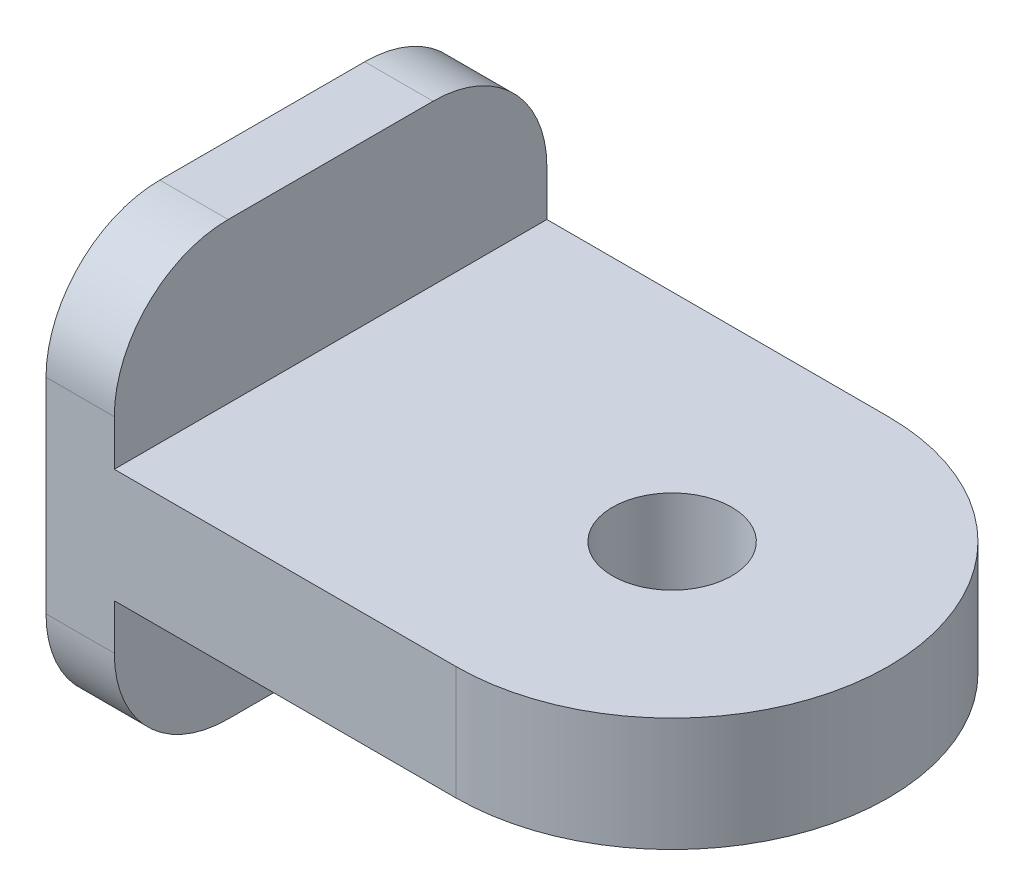
ISO-10303-21;
HEADER;
FILE_DESCRIPTION(('STEP AP214'),'2;1');
FILE_NAME('part.step','',(''),(''),'','','');
FILE_SCHEMA(('AUTOMOTIVE_DESIGN { 1 0 10303 214 1 1 1 1 }'));
ENDSEC;
DATA;
#1=APPLICATION_CONTEXT('core data for automotive mechanical design processes');
#2=APPLICATION_PROTOCOL_DEFINITION('international standard','automotive_design',2000,#1);
#3=PRODUCT_CONTEXT('',#1,'mechanical');
#4=PRODUCT('Part','Part','',(#3));
#5=PRODUCT_RELATED_PRODUCT_CATEGORY('part','',(#4));
#6=PRODUCT_DEFINITION_FORMATION('','',#4);
#7=PRODUCT_DEFINITION_CONTEXT('part definition',#1,'design');
#8=PRODUCT_DEFINITION('design','',#6,#7);
#9=PRODUCT_DEFINITION_SHAPE('','',#8);
#10=(LENGTH_UNIT() NAMED_UNIT(*) SI_UNIT(.MILLI.,.METRE.));
#11=(NAMED_UNIT(*) PLANE_ANGLE_UNIT() SI_UNIT($,.RADIAN.));
#12=(NAMED_UNIT(*) SI_UNIT($,.STERADIAN.) SOLID_ANGLE_UNIT());
#13=UNCERTAINTY_MEASURE_WITH_UNIT(LENGTH_MEASURE(1.E-05),#10,'distance_accuracy_value','');
#14=(GEOMETRIC_REPRESENTATION_CONTEXT(3) GLOBAL_UNCERTAINTY_ASSIGNED_CONTEXT((#13)) GLOBAL_UNIT_ASSIGNED_CONTEXT((#10,
#11,#12)) REPRESENTATION_CONTEXT('',''));
#15=CARTESIAN_POINT('',(0.,0.,0.));
#16=DIRECTION('',(0.,0.,1.));
#17=DIRECTION('',(1.,0.,0.));
#18=AXIS2_PLACEMENT_3D('',#15,#16,#17);
#19=CARTESIAN_POINT('',(20.,4.5,4.5));
#20=DIRECTION('',(1.,0.,0.));
#21=DIRECTION('',(0.,0.,-1.));
#22=AXIS2_PLACEMENT_3D('',#19,#20,#21);
#23=PLANE('',#22);
#24=DIRECTION('',(0.,0.,1.));
#25=VECTOR('',#24,1.);
#26=CARTESIAN_POINT('',(20.,2.5,9.5));
#27=LINE('',#26,#25);
#28=CARTESIAN_POINT('',(20.,2.5,-9.5));
#29=VERTEX_POINT('',#28);
#30=CARTESIAN_POINT('',(20.,2.5,9.5));
#31=VERTEX_POINT('',#30);
#32=EDGE_CURVE('E48',#29,#31,#27,.T.);
#33=ORIENTED_EDGE('',*,*,#32,.F.);
#34=DIRECTION('',(0.,1.,0.));
#35=VECTOR('',#34,1.);
#36=CARTESIAN_POINT('',(20.,-4.5,-9.5));
#37=LINE('',#36,#35);
#38=CARTESIAN_POINT('',(20.,4.5,-9.5));
#39=VERTEX_POINT('',#38);
#40=EDGE_CURVE('E172',#29,#39,#37,.T.);
#41=ORIENTED_EDGE('',*,*,#40,.T.);
#42=CARTESIAN_POINT('',(20.,4.5,-4.5));
#43=DIRECTION('',(1.,0.,0.));
#44=DIRECTION('',(0.,0.,-1.));
#45=AXIS2_PLACEMENT_3D('',#42,#43,#44);
#46=CIRCLE('',#45,5.);
#47=CARTESIAN_POINT('',(20.,9.5,-4.5));
#48=VERTEX_POINT('',#47);
#49=EDGE_CURVE('E175',#39,#48,#46,.T.);
#50=ORIENTED_EDGE('',*,*,#49,.T.);
#51=DIRECTION('',(0.,0.,1.));
#52=VECTOR('',#51,1.);
#53=CARTESIAN_POINT('',(20.,9.5,-4.5));
#54=LINE('',#53,#52);
#55=CARTESIAN_POINT('',(20.,9.5,4.5));
#56=VERTEX_POINT('',#55);
#57=EDGE_CURVE('E177',#48,#56,#54,.T.);
#58=ORIENTED_EDGE('',*,*,#57,.T.);
#59=CARTESIAN_POINT('',(20.,4.5,4.5));
#60=DIRECTION('',(1.,0.,0.));
#61=DIRECTION('',(0.,0.,-1.));
#62=AXIS2_PLACEMENT_3D('',#59,#60,#61);
#63=CIRCLE('',#62,5.);
#64=CARTESIAN_POINT('',(20.,4.5,9.5));
#65=VERTEX_POINT('',#64);
#66=EDGE_CURVE('E159',#56,#65,#63,.T.);
#67=ORIENTED_EDGE('',*,*,#66,.T.);
#68=DIRECTION('',(0.,-1.,0.));
#69=VECTOR('',#68,1.);
#70=CARTESIAN_POINT('',(20.,4.5,9.5));
#71=LINE('',#70,#69);
#72=EDGE_CURVE('E164',#65,#31,#71,.T.);
#73=ORIENTED_EDGE('',*,*,#72,.T.);
#74=EDGE_LOOP('',(#33,#41,#50,#58,#67,#73));
#75=FACE_BOUND('',#74,.T.);
#76=ADVANCED_FACE('F32',(#75),#23,.T.);
#77=CARTESIAN_POINT('',(20.,4.5,4.5));
#78=DIRECTION('',(-1.,0.,0.));
#79=DIRECTION('',(0.,0.,1.));
#80=AXIS2_PLACEMENT_3D('',#77,#78,#79);
#81=CYLINDRICAL_SURFACE('',#80,5.);
#82=CARTESIAN_POINT('',(17.,4.5,4.5));
#83=DIRECTION('',(1.,0.,0.));
#84=DIRECTION('',(0.,0.,-1.));
#85=AXIS2_PLACEMENT_3D('',#82,#83,#84);
#86=CIRCLE('',#85,5.);
#87=CARTESIAN_POINT('',(17.,9.5,4.5));
#88=VERTEX_POINT('',#87);
#89=CARTESIAN_POINT('',(17.,4.5,9.5));
#90=VERTEX_POINT('',#89);
#91=EDGE_CURVE('E158',#88,#90,#86,.T.);
#92=ORIENTED_EDGE('',*,*,#91,.T.);
#93=DIRECTION('',(-1.,0.,0.));
#94=VECTOR('',#93,1.);
#95=CARTESIAN_POINT('',(20.,4.5,9.5));
#96=LINE('',#95,#94);
#97=EDGE_CURVE('E11',#65,#90,#96,.T.);
#98=ORIENTED_EDGE('',*,*,#97,.F.);
#99=ORIENTED_EDGE('',*,*,#66,.F.);
#100=DIRECTION('',(-1.,0.,0.));
#101=VECTOR('',#100,1.);
#102=CARTESIAN_POINT('',(20.,9.5,4.5));
#103=LINE('',#102,#101);
#104=EDGE_CURVE('E179',#56,#88,#103,.T.);
#105=ORIENTED_EDGE('',*,*,#104,.T.);
#106=EDGE_LOOP('',(#92,#98,#99,#105));
#107=FACE_BOUND('',#106,.T.);
#108=ADVANCED_FACE('F34',(#107),#81,.T.);
#109=CARTESIAN_POINT('',(20.,4.5,9.5));
#110=DIRECTION('',(0.,0.,-1.));
#111=DIRECTION('',(-1.,0.,0.));
#112=AXIS2_PLACEMENT_3D('',#109,#110,#111);
#113=PLANE('',#112);
#114=DIRECTION('',(0.,-1.,0.));
#115=VECTOR('',#114,1.);
#116=CARTESIAN_POINT('',(17.,4.5,9.5));
#117=LINE('',#116,#115);
#118=CARTESIAN_POINT('',(17.,-4.5,9.5));
#119=VERTEX_POINT('',#118);
#120=EDGE_CURVE('E182',#90,#119,#117,.T.);
#121=ORIENTED_EDGE('',*,*,#120,.T.);
#122=DIRECTION('',(-1.,0.,0.));
#123=VECTOR('',#122,1.);
#124=CARTESIAN_POINT('',(20.,-4.5,9.5));
#125=LINE('',#124,#123);
#126=CARTESIAN_POINT('',(20.,-4.5,9.5));
#127=VERTEX_POINT('',#126);
#128=EDGE_CURVE('E41',#127,#119,#125,.T.);
#129=ORIENTED_EDGE('',*,*,#128,.F.);
#130=CARTESIAN_POINT('',(20.,-2.5,9.5));
#131=VERTEX_POINT('',#130);
#132=EDGE_CURVE('E162',#131,#127,#71,.T.);
#133=ORIENTED_EDGE('',*,*,#132,.F.);
#134=DIRECTION('',(-1.,0.,0.));
#135=VECTOR('',#134,1.);
#136=CARTESIAN_POINT('',(35.,-2.5,9.5));
#137=LINE('',#136,#135);
#138=CARTESIAN_POINT('',(35.,-2.5,9.5));
#139=VERTEX_POINT('',#138);
#140=EDGE_CURVE('E127',#139,#131,#137,.T.);
#141=ORIENTED_EDGE('',*,*,#140,.F.);
#142=DIRECTION('',(0.,-1.,0.));
#143=VECTOR('',#142,1.);
#144=CARTESIAN_POINT('',(35.,2.5,9.5));
#145=LINE('',#144,#143);
#146=CARTESIAN_POINT('',(35.,2.5,9.5));
#147=VERTEX_POINT('',#146);
#148=EDGE_CURVE('E122',#147,#139,#145,.T.);
#149=ORIENTED_EDGE('',*,*,#148,.F.);
#150=DIRECTION('',(-1.,0.,0.));
#151=VECTOR('',#150,1.);
#152=CARTESIAN_POINT('',(35.,2.5,9.5));
#153=LINE('',#152,#151);
#154=EDGE_CURVE('E125',#147,#31,#153,.T.);
#155=ORIENTED_EDGE('',*,*,#154,.T.);
#156=ORIENTED_EDGE('',*,*,#72,.F.);
#157=ORIENTED_EDGE('',*,*,#97,.T.);
#158=EDGE_LOOP('',(#121,#129,#133,#141,#149,#155,#156,#157));
#159=FACE_BOUND('',#158,.T.);
#160=ADVANCED_FACE('F124',(#159),#113,.F.);
#161=CARTESIAN_POINT('',(20.,-4.5,4.5));
#162=DIRECTION('',(-1.,0.,0.));
#163=DIRECTION('',(0.,0.,1.));
#164=AXIS2_PLACEMENT_3D('',#161,#162,#163);
#165=CYLINDRICAL_SURFACE('',#164,5.);
#166=CARTESIAN_POINT('',(17.,-4.5,4.5));
#167=DIRECTION('',(1.,0.,0.));
#168=DIRECTION('',(0.,0.,-1.));
#169=AXIS2_PLACEMENT_3D('',#166,#167,#168);
#170=CIRCLE('',#169,5.);
#171=CARTESIAN_POINT('',(17.,-9.5,4.5));
#172=VERTEX_POINT('',#171);
#173=EDGE_CURVE('E184',#119,#172,#170,.T.);
#174=ORIENTED_EDGE('',*,*,#173,.T.);
#175=DIRECTION('',(-1.,0.,0.));
#176=VECTOR('',#175,1.);
#177=CARTESIAN_POINT('',(20.,-9.5,4.5));
#178=LINE('',#177,#176);
#179=CARTESIAN_POINT('',(20.,-9.5,4.5));
#180=VERTEX_POINT('',#179);
#181=EDGE_CURVE('E209',#180,#172,#178,.T.);
#182=ORIENTED_EDGE('',*,*,#181,.F.);
#183=CARTESIAN_POINT('',(20.,-4.5,4.5));
#184=DIRECTION('',(1.,0.,0.));
#185=DIRECTION('',(0.,0.,-1.));
#186=AXIS2_PLACEMENT_3D('',#183,#184,#185);
#187=CIRCLE('',#186,5.);
#188=EDGE_CURVE('E166',#127,#180,#187,.T.);
#189=ORIENTED_EDGE('',*,*,#188,.F.);
#190=ORIENTED_EDGE('',*,*,#128,.T.);
#191=EDGE_LOOP('',(#174,#182,#189,#190));
#192=FACE_BOUND('',#191,.T.);
#193=ADVANCED_FACE('F217',(#192),#165,.T.);
#194=CARTESIAN_POINT('',(20.,-9.5,4.5));
#195=DIRECTION('',(0.,1.,0.));
#196=DIRECTION('',(0.,0.,1.));
#197=AXIS2_PLACEMENT_3D('',#194,#195,#196);
#198=PLANE('',#197);
#199=DIRECTION('',(0.,0.,-1.));
#200=VECTOR('',#199,1.);
#201=CARTESIAN_POINT('',(17.,-9.5,4.5));
#202=LINE('',#201,#200);
#203=CARTESIAN_POINT('',(17.,-9.5,-4.5));
#204=VERTEX_POINT('',#203);
#205=EDGE_CURVE('E186',#172,#204,#202,.T.);
#206=ORIENTED_EDGE('',*,*,#205,.T.);
#207=DIRECTION('',(-1.,0.,0.));
#208=VECTOR('',#207,1.);
#209=CARTESIAN_POINT('',(20.,-9.5,-4.5));
#210=LINE('',#209,#208);
#211=CARTESIAN_POINT('',(20.,-9.5,-4.5));
#212=VERTEX_POINT('',#211);
#213=EDGE_CURVE('E206',#212,#204,#210,.T.);
#214=ORIENTED_EDGE('',*,*,#213,.F.);
#215=DIRECTION('',(0.,0.,-1.));
#216=VECTOR('',#215,1.);
#217=CARTESIAN_POINT('',(20.,-9.5,4.5));
#218=LINE('',#217,#216);
#219=EDGE_CURVE('E168',#180,#212,#218,.T.);
#220=ORIENTED_EDGE('',*,*,#219,.F.);
#221=ORIENTED_EDGE('',*,*,#181,.T.);
#222=EDGE_LOOP('',(#206,#214,#220,#221));
#223=FACE_BOUND('',#222,.T.);
#224=ADVANCED_FACE('F227',(#223),#198,.F.);
#225=CARTESIAN_POINT('',(20.,-4.5,-4.5));
#226=DIRECTION('',(-1.,0.,0.));
#227=DIRECTION('',(0.,0.,1.));
#228=AXIS2_PLACEMENT_3D('',#225,#226,#227);
#229=CYLINDRICAL_SURFACE('',#228,5.);
#230=CARTESIAN_POINT('',(17.,-4.5,-4.5));
#231=DIRECTION('',(1.,0.,0.));
#232=DIRECTION('',(0.,0.,-1.));
#233=AXIS2_PLACEMENT_3D('',#230,#231,#232);
#234=CIRCLE('',#233,5.);
#235=CARTESIAN_POINT('',(17.,-4.5,-9.5));
#236=VERTEX_POINT('',#235);
#237=EDGE_CURVE('E188',#204,#236,#234,.T.);
#238=ORIENTED_EDGE('',*,*,#237,.T.);
#239=DIRECTION('',(-1.,0.,0.));
#240=VECTOR('',#239,1.);
#241=CARTESIAN_POINT('',(20.,-4.5,-9.5));
#242=LINE('',#241,#240);
#243=CARTESIAN_POINT('',(20.,-4.5,-9.5));
#244=VERTEX_POINT('',#243);
#245=EDGE_CURVE('E203',#244,#236,#242,.T.);
#246=ORIENTED_EDGE('',*,*,#245,.F.);
#247=CARTESIAN_POINT('',(20.,-4.5,-4.5));
#248=DIRECTION('',(1.,0.,0.));
#249=DIRECTION('',(0.,0.,-1.));
#250=AXIS2_PLACEMENT_3D('',#247,#248,#249);
#251=CIRCLE('',#250,5.);
#252=EDGE_CURVE('E170',#212,#244,#251,.T.);
#253=ORIENTED_EDGE('',*,*,#252,.F.);
#254=ORIENTED_EDGE('',*,*,#213,.T.);
#255=EDGE_LOOP('',(#238,#246,#253,#254));
#256=FACE_BOUND('',#255,.T.);
#257=ADVANCED_FACE('F231',(#256),#229,.T.);
#258=CARTESIAN_POINT('',(20.,-4.5,-9.5));
#259=DIRECTION('',(0.,0.,1.));
#260=DIRECTION('',(1.,0.,0.));
#261=AXIS2_PLACEMENT_3D('',#258,#259,#260);
#262=PLANE('',#261);
#263=DIRECTION('',(0.,1.,0.));
#264=VECTOR('',#263,1.);
#265=CARTESIAN_POINT('',(17.,-4.5,-9.5));
#266=LINE('',#265,#264);
#267=CARTESIAN_POINT('',(17.,4.5,-9.5));
#268=VERTEX_POINT('',#267);
#269=EDGE_CURVE('E190',#236,#268,#266,.T.);
#270=ORIENTED_EDGE('',*,*,#269,.T.);
#271=DIRECTION('',(-1.,0.,0.));
#272=VECTOR('',#271,1.);
#273=CARTESIAN_POINT('',(20.,4.5,-9.5));
#274=LINE('',#273,#272);
#275=EDGE_CURVE('E200',#39,#268,#274,.T.);
#276=ORIENTED_EDGE('',*,*,#275,.F.);
#277=ORIENTED_EDGE('',*,*,#40,.F.);
#278=DIRECTION('',(-1.,0.,0.));
#279=VECTOR('',#278,1.);
#280=CARTESIAN_POINT('',(35.,2.5,-9.5));
#281=LINE('',#280,#279);
#282=CARTESIAN_POINT('',(35.,2.5,-9.5));
#283=VERTEX_POINT('',#282);
#284=EDGE_CURVE('E140',#283,#29,#281,.T.);
#285=ORIENTED_EDGE('',*,*,#284,.F.);
#286=DIRECTION('',(0.,1.,0.));
#287=VECTOR('',#286,1.);
#288=CARTESIAN_POINT('',(35.,2.5,-9.5));
#289=LINE('',#288,#287);
#290=CARTESIAN_POINT('',(35.,-2.5,-9.5));
#291=VERTEX_POINT('',#290);
#292=EDGE_CURVE('E132',#291,#283,#289,.T.);
#293=ORIENTED_EDGE('',*,*,#292,.F.);
#294=DIRECTION('',(-1.,0.,0.));
#295=VECTOR('',#294,1.);
#296=CARTESIAN_POINT('',(35.,-2.5,-9.5));
#297=LINE('',#296,#295);
#298=CARTESIAN_POINT('',(20.,-2.5,-9.5));
#299=VERTEX_POINT('',#298);
#300=EDGE_CURVE('E154',#291,#299,#297,.T.);
#301=ORIENTED_EDGE('',*,*,#300,.T.);
#302=EDGE_CURVE('E173',#244,#299,#37,.T.);
#303=ORIENTED_EDGE('',*,*,#302,.F.);
#304=ORIENTED_EDGE('',*,*,#245,.T.);
#305=EDGE_LOOP('',(#270,#276,#277,#285,#293,#301,#303,#304));
#306=FACE_BOUND('',#305,.T.);
#307=ADVANCED_FACE('F238',(#306),#262,.F.);
#308=CARTESIAN_POINT('',(20.,4.5,-4.5));
#309=DIRECTION('',(-1.,0.,0.));
#310=DIRECTION('',(0.,0.,1.));
#311=AXIS2_PLACEMENT_3D('',#308,#309,#310);
#312=CYLINDRICAL_SURFACE('',#311,5.);
#313=CARTESIAN_POINT('',(17.,4.5,-4.5));
#314=DIRECTION('',(1.,0.,0.));
#315=DIRECTION('',(0.,0.,-1.));
#316=AXIS2_PLACEMENT_3D('',#313,#314,#315);
#317=CIRCLE('',#316,5.);
#318=CARTESIAN_POINT('',(17.,9.5,-4.5));
#319=VERTEX_POINT('',#318);
#320=EDGE_CURVE('E192',#268,#319,#317,.T.);
#321=ORIENTED_EDGE('',*,*,#320,.T.);
#322=DIRECTION('',(-1.,0.,0.));
#323=VECTOR('',#322,1.);
#324=CARTESIAN_POINT('',(20.,9.5,-4.5));
#325=LINE('',#324,#323);
#326=EDGE_CURVE('E197',#48,#319,#325,.T.);
#327=ORIENTED_EDGE('',*,*,#326,.F.);
#328=ORIENTED_EDGE('',*,*,#49,.F.);
#329=ORIENTED_EDGE('',*,*,#275,.T.);
#330=EDGE_LOOP('',(#321,#327,#328,#329));
#331=FACE_BOUND('',#330,.T.);
#332=ADVANCED_FACE('F245',(#331),#312,.T.);
#333=CARTESIAN_POINT('',(20.,9.5,-4.5));
#334=DIRECTION('',(0.,-1.,0.));
#335=DIRECTION('',(0.,0.,-1.));
#336=AXIS2_PLACEMENT_3D('',#333,#334,#335);
#337=PLANE('',#336);
#338=DIRECTION('',(0.,0.,1.));
#339=VECTOR('',#338,1.);
#340=CARTESIAN_POINT('',(17.,9.5,-4.5));
#341=LINE('',#340,#339);
#342=EDGE_CURVE('E163',#319,#88,#341,.T.);
#343=ORIENTED_EDGE('',*,*,#342,.T.);
#344=ORIENTED_EDGE('',*,*,#104,.F.);
#345=ORIENTED_EDGE('',*,*,#57,.F.);
#346=ORIENTED_EDGE('',*,*,#326,.T.);
#347=EDGE_LOOP('',(#343,#344,#345,#346));
#348=FACE_BOUND('',#347,.T.);
#349=ADVANCED_FACE('F249',(#348),#337,.F.);
#350=DIRECTION('',(0.,0.,-1.));
#351=VECTOR('',#350,1.);
#352=CARTESIAN_POINT('',(20.,-2.5,9.5));
#353=LINE('',#352,#351);
#354=EDGE_CURVE('E56',#131,#299,#353,.T.);
#355=ORIENTED_EDGE('',*,*,#354,.F.);
#356=ORIENTED_EDGE('',*,*,#132,.T.);
#357=ORIENTED_EDGE('',*,*,#188,.T.);
#358=ORIENTED_EDGE('',*,*,#219,.T.);
#359=ORIENTED_EDGE('',*,*,#252,.T.);
#360=ORIENTED_EDGE('',*,*,#302,.T.);
#361=EDGE_LOOP('',(#355,#356,#357,#358,#359,#360));
#362=FACE_BOUND('',#361,.T.);
#363=ADVANCED_FACE('F234',(#362),#23,.T.);
#364=CARTESIAN_POINT('',(17.,4.5,4.5));
#365=DIRECTION('',(1.,0.,0.));
#366=DIRECTION('',(0.,0.,-1.));
#367=AXIS2_PLACEMENT_3D('',#364,#365,#366);
#368=PLANE('',#367);
#369=ORIENTED_EDGE('',*,*,#91,.F.);
#370=ORIENTED_EDGE('',*,*,#342,.F.);
#371=ORIENTED_EDGE('',*,*,#320,.F.);
#372=ORIENTED_EDGE('',*,*,#269,.F.);
#373=ORIENTED_EDGE('',*,*,#237,.F.);
#374=ORIENTED_EDGE('',*,*,#205,.F.);
#375=ORIENTED_EDGE('',*,*,#173,.F.);
#376=ORIENTED_EDGE('',*,*,#120,.F.);
#377=EDGE_LOOP('',(#369,#370,#371,#372,#373,#374,#375,#376));
#378=FACE_BOUND('',#377,.T.);
#379=ADVANCED_FACE('F222',(#378),#368,.F.);
#380=CARTESIAN_POINT('',(35.,-2.5,9.5));
#381=DIRECTION('',(0.,1.,0.));
#382=DIRECTION('',(0.,0.,1.));
#383=AXIS2_PLACEMENT_3D('',#380,#381,#382);
#384=PLANE('',#383);
#385=CARTESIAN_POINT('',(35.,-2.5,0.));
#386=DIRECTION('',(0.,-1.,0.));
#387=DIRECTION('',(0.,0.,-1.));
#388=AXIS2_PLACEMENT_3D('',#385,#386,#387);
#389=CIRCLE('',#388,2.61742961917909);
#390=CARTESIAN_POINT('',(35.,-2.5,-2.61742961917909));
#391=VERTEX_POINT('',#390);
#392=EDGE_CURVE('E149',#391,#391,#389,.T.);
#393=ORIENTED_EDGE('',*,*,#392,.F.);
#394=EDGE_LOOP('',(#393));
#395=FACE_BOUND('',#394,.T.);
#396=ORIENTED_EDGE('',*,*,#354,.T.);
#397=ORIENTED_EDGE('',*,*,#300,.F.);
#398=CARTESIAN_POINT('',(35.,-2.5,0.));
#399=DIRECTION('',(0.,-1.,0.));
#400=DIRECTION('',(0.,0.,1.));
#401=AXIS2_PLACEMENT_3D('',#398,#399,#400);
#402=CIRCLE('',#401,9.5);
#403=EDGE_CURVE('E144',#291,#139,#402,.T.);
#404=ORIENTED_EDGE('',*,*,#403,.T.);
#405=ORIENTED_EDGE('',*,*,#140,.T.);
#406=EDGE_LOOP('',(#396,#397,#404,#405));
#407=FACE_BOUND('',#406,.T.);
#408=ADVANCED_FACE('F236',(#395,#407),#384,.F.);
#409=CARTESIAN_POINT('',(35.,2.5,9.5));
#410=DIRECTION('',(0.,-1.,0.));
#411=DIRECTION('',(0.,0.,-1.));
#412=AXIS2_PLACEMENT_3D('',#409,#410,#411);
#413=PLANE('',#412);
#414=CARTESIAN_POINT('',(35.,2.5,0.));
#415=DIRECTION('',(0.,-1.,0.));
#416=DIRECTION('',(0.,0.,-1.));
#417=AXIS2_PLACEMENT_3D('',#414,#415,#416);
#418=CIRCLE('',#417,2.61742961917909);
#419=CARTESIAN_POINT('',(35.,2.5,-2.61742961917909));
#420=VERTEX_POINT('',#419);
#421=EDGE_CURVE('E36',#420,#420,#418,.T.);
#422=ORIENTED_EDGE('',*,*,#421,.T.);
#423=EDGE_LOOP('',(#422));
#424=FACE_BOUND('',#423,.T.);
#425=ORIENTED_EDGE('',*,*,#32,.T.);
#426=ORIENTED_EDGE('',*,*,#154,.F.);
#427=CARTESIAN_POINT('',(35.,2.5,0.));
#428=DIRECTION('',(0.,-1.,0.));
#429=DIRECTION('',(0.,0.,-1.));
#430=AXIS2_PLACEMENT_3D('',#427,#428,#429);
#431=CIRCLE('',#430,9.5);
#432=EDGE_CURVE('E138',#147,#283,#431,.F.);
#433=ORIENTED_EDGE('',*,*,#432,.T.);
#434=ORIENTED_EDGE('',*,*,#284,.T.);
#435=EDGE_LOOP('',(#425,#426,#433,#434));
#436=FACE_BOUND('',#435,.T.);
#437=ADVANCED_FACE('F136',(#424,#436),#413,.F.);
#438=CARTESIAN_POINT('',(35.,23.742645786248,0.));
#439=DIRECTION('',(0.,-1.,0.));
#440=DIRECTION('',(0.,0.,-1.));
#441=AXIS2_PLACEMENT_3D('',#438,#439,#440);
#442=CYLINDRICAL_SURFACE('',#441,9.5);
#443=ORIENTED_EDGE('',*,*,#432,.F.);
#444=ORIENTED_EDGE('',*,*,#148,.T.);
#445=ORIENTED_EDGE('',*,*,#403,.F.);
#446=ORIENTED_EDGE('',*,*,#292,.T.);
#447=EDGE_LOOP('',(#443,#444,#445,#446));
#448=FACE_BOUND('',#447,.T.);
#449=ADVANCED_FACE('F142',(#448),#442,.T.);
#450=CARTESIAN_POINT('',(35.,12.5,0.));
#451=DIRECTION('',(0.,-1.,0.));
#452=DIRECTION('',(0.,0.,-1.));
#453=AXIS2_PLACEMENT_3D('',#450,#451,#452);
#454=CYLINDRICAL_SURFACE('',#453,2.61742961917909);
#455=ORIENTED_EDGE('',*,*,#392,.T.);
#456=EDGE_LOOP('',(#455));
#457=FACE_BOUND('',#456,.T.);
#458=ORIENTED_EDGE('',*,*,#421,.F.);
#459=EDGE_LOOP('',(#458));
#460=FACE_BOUND('',#459,.T.);
#461=ADVANCED_FACE('F363',(#457,#460),#454,.F.);
#462=CLOSED_SHELL('',(#76,#108,#160,#193,#224,#257,#307,#332,#349,#363,#379,#408,#437,#449,#461));
#463=MANIFOLD_SOLID_BREP('B2',#462);
#464=ADVANCED_BREP_SHAPE_REPRESENTATION('',(#18,#463),#14);
#465=SHAPE_DEFINITION_REPRESENTATION(#9,#464);
ENDSEC;
END-ISO-10303-21;
